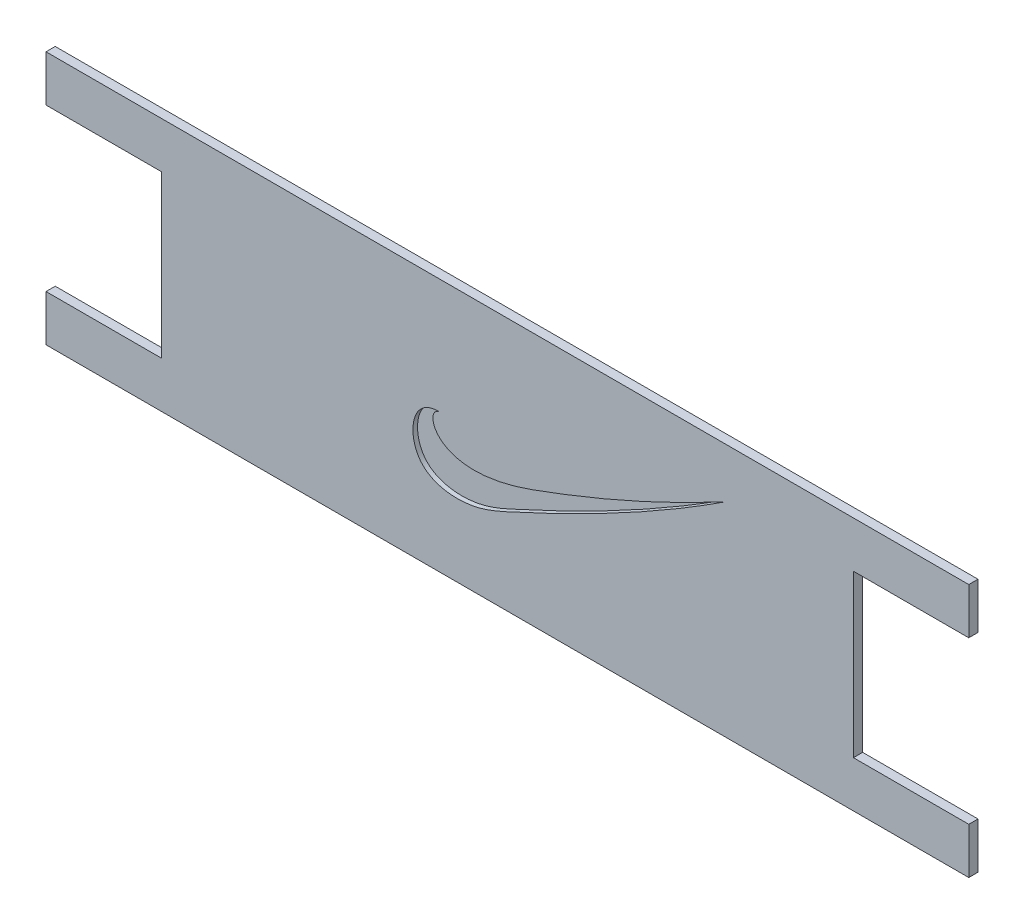
ISO-10303-21;
HEADER;
FILE_DESCRIPTION(('STEP AP214'),'2;1');
FILE_NAME('part.step','',(''),(''),'','','');
FILE_SCHEMA(('AUTOMOTIVE_DESIGN { 1 0 10303 214 1 1 1 1 }'));
ENDSEC;
DATA;
#1=APPLICATION_CONTEXT('core data for automotive mechanical design processes');
#2=APPLICATION_PROTOCOL_DEFINITION('international standard','automotive_design',2000,#1);
#3=PRODUCT_CONTEXT('',#1,'mechanical');
#4=PRODUCT('Part','Part','',(#3));
#5=PRODUCT_RELATED_PRODUCT_CATEGORY('part','',(#4));
#6=PRODUCT_DEFINITION_FORMATION('','',#4);
#7=PRODUCT_DEFINITION_CONTEXT('part definition',#1,'design');
#8=PRODUCT_DEFINITION('design','',#6,#7);
#9=PRODUCT_DEFINITION_SHAPE('','',#8);
#10=(LENGTH_UNIT() NAMED_UNIT(*) SI_UNIT(.MILLI.,.METRE.));
#11=(NAMED_UNIT(*) PLANE_ANGLE_UNIT() SI_UNIT($,.RADIAN.));
#12=(NAMED_UNIT(*) SI_UNIT($,.STERADIAN.) SOLID_ANGLE_UNIT());
#13=UNCERTAINTY_MEASURE_WITH_UNIT(LENGTH_MEASURE(1.E-05),#10,'distance_accuracy_value','');
#14=(GEOMETRIC_REPRESENTATION_CONTEXT(3) GLOBAL_UNCERTAINTY_ASSIGNED_CONTEXT((#13)) GLOBAL_UNIT_ASSIGNED_CONTEXT((#10,
#11,#12)) REPRESENTATION_CONTEXT('',''));
#15=CARTESIAN_POINT('',(0.,0.,0.));
#16=DIRECTION('',(0.,0.,1.));
#17=DIRECTION('',(1.,0.,0.));
#18=AXIS2_PLACEMENT_3D('',#15,#16,#17);
#19=CARTESIAN_POINT('',(-48.3108108108107,14.2439742014154,2.));
#20=DIRECTION('',(1.,0.,0.));
#21=DIRECTION('',(0.,1.,0.));
#22=AXIS2_PLACEMENT_3D('',#19,#20,#21);
#23=PLANE('',#22);
#24=DIRECTION('',(0.,-1.,0.));
#25=VECTOR('',#24,1.);
#26=CARTESIAN_POINT('',(-48.3108108108107,14.2439742014154,0.));
#27=LINE('',#26,#25);
#28=CARTESIAN_POINT('',(-48.3108108108107,14.2439742014154,0.));
#29=VERTEX_POINT('',#28);
#30=CARTESIAN_POINT('',(-48.3108108108107,4.24397420141542,0.));
#31=VERTEX_POINT('',#30);
#32=EDGE_CURVE('E176',#29,#31,#27,.T.);
#33=ORIENTED_EDGE('',*,*,#32,.T.);
#34=DIRECTION('',(0.,0.,-1.));
#35=VECTOR('',#34,1.);
#36=CARTESIAN_POINT('',(-48.3108108108107,4.24397420141542,2.));
#37=LINE('',#36,#35);
#38=CARTESIAN_POINT('',(-48.3108108108107,4.24397420141542,2.));
#39=VERTEX_POINT('',#38);
#40=EDGE_CURVE('E11',#39,#31,#37,.T.);
#41=ORIENTED_EDGE('',*,*,#40,.F.);
#42=DIRECTION('',(0.,-1.,0.));
#43=VECTOR('',#42,1.);
#44=CARTESIAN_POINT('',(-48.3108108108107,14.2439742014154,2.));
#45=LINE('',#44,#43);
#46=CARTESIAN_POINT('',(-48.3108108108107,14.2439742014154,2.));
#47=VERTEX_POINT('',#46);
#48=EDGE_CURVE('E212',#47,#39,#45,.T.);
#49=ORIENTED_EDGE('',*,*,#48,.F.);
#50=DIRECTION('',(0.,0.,-1.));
#51=VECTOR('',#50,1.);
#52=CARTESIAN_POINT('',(-48.3108108108107,14.2439742014154,2.));
#53=LINE('',#52,#51);
#54=EDGE_CURVE('E172',#47,#29,#53,.T.);
#55=ORIENTED_EDGE('',*,*,#54,.T.);
#56=EDGE_LOOP('',(#33,#41,#49,#55));
#57=FACE_BOUND('',#56,.T.);
#58=ADVANCED_FACE('F39',(#57),#23,.F.);
#59=CARTESIAN_POINT('',(-23.3108108108107,4.24397420141542,2.));
#60=DIRECTION('',(0.,1.,0.));
#61=DIRECTION('',(-1.,0.,0.));
#62=AXIS2_PLACEMENT_3D('',#59,#60,#61);
#63=PLANE('',#62);
#64=DIRECTION('',(1.,0.,0.));
#65=VECTOR('',#64,1.);
#66=CARTESIAN_POINT('',(-23.3108108108107,4.24397420141542,0.));
#67=LINE('',#66,#65);
#68=CARTESIAN_POINT('',(-23.3108108108107,4.24397420141542,0.));
#69=VERTEX_POINT('',#68);
#70=EDGE_CURVE('E180',#31,#69,#67,.T.);
#71=ORIENTED_EDGE('',*,*,#70,.T.);
#72=DIRECTION('',(0.,0.,-1.));
#73=VECTOR('',#72,1.);
#74=CARTESIAN_POINT('',(-23.3108108108107,4.24397420141542,2.));
#75=LINE('',#74,#73);
#76=CARTESIAN_POINT('',(-23.3108108108107,4.24397420141542,2.));
#77=VERTEX_POINT('',#76);
#78=EDGE_CURVE('E47',#77,#69,#75,.T.);
#79=ORIENTED_EDGE('',*,*,#78,.F.);
#80=DIRECTION('',(1.,0.,0.));
#81=VECTOR('',#80,1.);
#82=CARTESIAN_POINT('',(-23.3108108108107,4.24397420141542,2.));
#83=LINE('',#82,#81);
#84=EDGE_CURVE('E116',#39,#77,#83,.T.);
#85=ORIENTED_EDGE('',*,*,#84,.F.);
#86=ORIENTED_EDGE('',*,*,#40,.T.);
#87=EDGE_LOOP('',(#71,#79,#85,#86));
#88=FACE_BOUND('',#87,.T.);
#89=ADVANCED_FACE('F375',(#88),#63,.F.);
#90=CARTESIAN_POINT('',(-23.3108108108107,4.24397420141542,2.));
#91=DIRECTION('',(1.,0.,0.));
#92=DIRECTION('',(0.,0.,-1.));
#93=AXIS2_PLACEMENT_3D('',#90,#91,#92);
#94=PLANE('',#93);
#95=DIRECTION('',(0.,-1.,0.));
#96=VECTOR('',#95,1.);
#97=CARTESIAN_POINT('',(-23.3108108108107,4.24397420141542,0.));
#98=LINE('',#97,#96);
#99=CARTESIAN_POINT('',(-23.3108108108107,-30.7560257985846,0.));
#100=VERTEX_POINT('',#99);
#101=EDGE_CURVE('E184',#69,#100,#98,.T.);
#102=ORIENTED_EDGE('',*,*,#101,.T.);
#103=DIRECTION('',(0.,0.,-1.));
#104=VECTOR('',#103,1.);
#105=CARTESIAN_POINT('',(-23.3108108108107,-30.7560257985846,2.));
#106=LINE('',#105,#104);
#107=CARTESIAN_POINT('',(-23.3108108108107,-30.7560257985846,2.));
#108=VERTEX_POINT('',#107);
#109=EDGE_CURVE('E239',#108,#100,#106,.T.);
#110=ORIENTED_EDGE('',*,*,#109,.F.);
#111=DIRECTION('',(0.,-1.,0.));
#112=VECTOR('',#111,1.);
#113=CARTESIAN_POINT('',(-23.3108108108107,4.24397420141542,2.));
#114=LINE('',#113,#112);
#115=EDGE_CURVE('E249',#77,#108,#114,.T.);
#116=ORIENTED_EDGE('',*,*,#115,.F.);
#117=ORIENTED_EDGE('',*,*,#78,.T.);
#118=EDGE_LOOP('',(#102,#110,#116,#117));
#119=FACE_BOUND('',#118,.T.);
#120=ADVANCED_FACE('F247',(#119),#94,.F.);
#121=CARTESIAN_POINT('',(-48.3108108108107,-30.7560257985846,2.));
#122=DIRECTION('',(0.,-1.,0.));
#123=DIRECTION('',(0.,0.,-1.));
#124=AXIS2_PLACEMENT_3D('',#121,#122,#123);
#125=PLANE('',#124);
#126=DIRECTION('',(-1.,0.,0.));
#127=VECTOR('',#126,1.);
#128=CARTESIAN_POINT('',(-48.3108108108107,-30.7560257985846,0.));
#129=LINE('',#128,#127);
#130=CARTESIAN_POINT('',(-48.3108108108107,-30.7560257985846,0.));
#131=VERTEX_POINT('',#130);
#132=EDGE_CURVE('E187',#100,#131,#129,.T.);
#133=ORIENTED_EDGE('',*,*,#132,.T.);
#134=DIRECTION('',(0.,0.,-1.));
#135=VECTOR('',#134,1.);
#136=CARTESIAN_POINT('',(-48.3108108108107,-30.7560257985846,2.));
#137=LINE('',#136,#135);
#138=CARTESIAN_POINT('',(-48.3108108108107,-30.7560257985846,2.));
#139=VERTEX_POINT('',#138);
#140=EDGE_CURVE('E235',#139,#131,#137,.T.);
#141=ORIENTED_EDGE('',*,*,#140,.F.);
#142=DIRECTION('',(-1.,0.,0.));
#143=VECTOR('',#142,1.);
#144=CARTESIAN_POINT('',(-48.3108108108107,-30.7560257985846,2.));
#145=LINE('',#144,#143);
#146=EDGE_CURVE('E268',#108,#139,#145,.T.);
#147=ORIENTED_EDGE('',*,*,#146,.F.);
#148=ORIENTED_EDGE('',*,*,#109,.T.);
#149=EDGE_LOOP('',(#133,#141,#147,#148));
#150=FACE_BOUND('',#149,.T.);
#151=ADVANCED_FACE('F258',(#150),#125,.F.);
#152=CARTESIAN_POINT('',(-48.3108108108107,-30.7560257985846,2.));
#153=DIRECTION('',(1.,0.,0.));
#154=DIRECTION('',(0.,0.,-1.));
#155=AXIS2_PLACEMENT_3D('',#152,#153,#154);
#156=PLANE('',#155);
#157=DIRECTION('',(0.,-1.,0.));
#158=VECTOR('',#157,1.);
#159=CARTESIAN_POINT('',(-48.3108108108107,-30.7560257985846,0.));
#160=LINE('',#159,#158);
#161=CARTESIAN_POINT('',(-48.3108108108107,-40.7560257985846,0.));
#162=VERTEX_POINT('',#161);
#163=EDGE_CURVE('E190',#131,#162,#160,.T.);
#164=ORIENTED_EDGE('',*,*,#163,.T.);
#165=DIRECTION('',(0.,0.,-1.));
#166=VECTOR('',#165,1.);
#167=CARTESIAN_POINT('',(-48.3108108108107,-40.7560257985846,2.));
#168=LINE('',#167,#166);
#169=CARTESIAN_POINT('',(-48.3108108108107,-40.7560257985846,2.));
#170=VERTEX_POINT('',#169);
#171=EDGE_CURVE('E231',#170,#162,#168,.T.);
#172=ORIENTED_EDGE('',*,*,#171,.F.);
#173=DIRECTION('',(0.,-1.,0.));
#174=VECTOR('',#173,1.);
#175=CARTESIAN_POINT('',(-48.3108108108107,-30.7560257985846,2.));
#176=LINE('',#175,#174);
#177=EDGE_CURVE('E264',#139,#170,#176,.T.);
#178=ORIENTED_EDGE('',*,*,#177,.F.);
#179=ORIENTED_EDGE('',*,*,#140,.T.);
#180=EDGE_LOOP('',(#164,#172,#178,#179));
#181=FACE_BOUND('',#180,.T.);
#182=ADVANCED_FACE('F262',(#181),#156,.F.);
#183=CARTESIAN_POINT('',(-48.3108108108107,-40.7560257985846,2.));
#184=DIRECTION('',(0.,1.,0.));
#185=DIRECTION('',(0.,0.,1.));
#186=AXIS2_PLACEMENT_3D('',#183,#184,#185);
#187=PLANE('',#186);
#188=DIRECTION('',(1.,0.,0.));
#189=VECTOR('',#188,1.);
#190=CARTESIAN_POINT('',(-48.3108108108107,-40.7560257985846,0.));
#191=LINE('',#190,#189);
#192=CARTESIAN_POINT('',(151.689189189189,-40.7560257985846,0.));
#193=VERTEX_POINT('',#192);
#194=EDGE_CURVE('E193',#162,#193,#191,.T.);
#195=ORIENTED_EDGE('',*,*,#194,.T.);
#196=DIRECTION('',(0.,0.,-1.));
#197=VECTOR('',#196,1.);
#198=CARTESIAN_POINT('',(151.689189189189,-40.7560257985846,2.));
#199=LINE('',#198,#197);
#200=CARTESIAN_POINT('',(151.689189189189,-40.7560257985846,2.));
#201=VERTEX_POINT('',#200);
#202=EDGE_CURVE('E227',#201,#193,#199,.T.);
#203=ORIENTED_EDGE('',*,*,#202,.F.);
#204=DIRECTION('',(1.,0.,0.));
#205=VECTOR('',#204,1.);
#206=CARTESIAN_POINT('',(-48.3108108108107,-40.7560257985846,2.));
#207=LINE('',#206,#205);
#208=EDGE_CURVE('E267',#170,#201,#207,.T.);
#209=ORIENTED_EDGE('',*,*,#208,.F.);
#210=ORIENTED_EDGE('',*,*,#171,.T.);
#211=EDGE_LOOP('',(#195,#203,#209,#210));
#212=FACE_BOUND('',#211,.T.);
#213=ADVANCED_FACE('F365',(#212),#187,.F.);
#214=CARTESIAN_POINT('',(151.689189189189,-30.7560257985846,2.));
#215=DIRECTION('',(-1.,0.,0.));
#216=DIRECTION('',(0.,0.,1.));
#217=AXIS2_PLACEMENT_3D('',#214,#215,#216);
#218=PLANE('',#217);
#219=DIRECTION('',(0.,1.,0.));
#220=VECTOR('',#219,1.);
#221=CARTESIAN_POINT('',(151.689189189189,-30.7560257985846,0.));
#222=LINE('',#221,#220);
#223=CARTESIAN_POINT('',(151.689189189189,-30.7560257985846,0.));
#224=VERTEX_POINT('',#223);
#225=EDGE_CURVE('E196',#193,#224,#222,.T.);
#226=ORIENTED_EDGE('',*,*,#225,.T.);
#227=DIRECTION('',(0.,0.,-1.));
#228=VECTOR('',#227,1.);
#229=CARTESIAN_POINT('',(151.689189189189,-30.7560257985846,2.));
#230=LINE('',#229,#228);
#231=CARTESIAN_POINT('',(151.689189189189,-30.7560257985846,2.));
#232=VERTEX_POINT('',#231);
#233=EDGE_CURVE('E223',#232,#224,#230,.T.);
#234=ORIENTED_EDGE('',*,*,#233,.F.);
#235=DIRECTION('',(0.,1.,0.));
#236=VECTOR('',#235,1.);
#237=CARTESIAN_POINT('',(151.689189189189,-30.7560257985846,2.));
#238=LINE('',#237,#236);
#239=EDGE_CURVE('E272',#201,#232,#238,.T.);
#240=ORIENTED_EDGE('',*,*,#239,.F.);
#241=ORIENTED_EDGE('',*,*,#202,.T.);
#242=EDGE_LOOP('',(#226,#234,#240,#241));
#243=FACE_BOUND('',#242,.T.);
#244=ADVANCED_FACE('F362',(#243),#218,.F.);
#245=CARTESIAN_POINT('',(126.689189189189,-30.7560257985846,2.));
#246=DIRECTION('',(0.,-1.,0.));
#247=DIRECTION('',(0.,0.,-1.));
#248=AXIS2_PLACEMENT_3D('',#245,#246,#247);
#249=PLANE('',#248);
#250=DIRECTION('',(-1.,0.,0.));
#251=VECTOR('',#250,1.);
#252=CARTESIAN_POINT('',(126.689189189189,-30.7560257985846,0.));
#253=LINE('',#252,#251);
#254=CARTESIAN_POINT('',(126.689189189189,-30.7560257985846,0.));
#255=VERTEX_POINT('',#254);
#256=EDGE_CURVE('E199',#224,#255,#253,.T.);
#257=ORIENTED_EDGE('',*,*,#256,.T.);
#258=DIRECTION('',(0.,0.,-1.));
#259=VECTOR('',#258,1.);
#260=CARTESIAN_POINT('',(126.689189189189,-30.7560257985846,2.));
#261=LINE('',#260,#259);
#262=CARTESIAN_POINT('',(126.689189189189,-30.7560257985846,2.));
#263=VERTEX_POINT('',#262);
#264=EDGE_CURVE('E219',#263,#255,#261,.T.);
#265=ORIENTED_EDGE('',*,*,#264,.F.);
#266=DIRECTION('',(-1.,0.,0.));
#267=VECTOR('',#266,1.);
#268=CARTESIAN_POINT('',(126.689189189189,-30.7560257985846,2.));
#269=LINE('',#268,#267);
#270=EDGE_CURVE('E279',#232,#263,#269,.T.);
#271=ORIENTED_EDGE('',*,*,#270,.F.);
#272=ORIENTED_EDGE('',*,*,#233,.T.);
#273=EDGE_LOOP('',(#257,#265,#271,#272));
#274=FACE_BOUND('',#273,.T.);
#275=ADVANCED_FACE('F287',(#274),#249,.F.);
#276=CARTESIAN_POINT('',(126.689189189189,4.24397420141543,2.));
#277=DIRECTION('',(-1.,0.,0.));
#278=DIRECTION('',(0.,0.,1.));
#279=AXIS2_PLACEMENT_3D('',#276,#277,#278);
#280=PLANE('',#279);
#281=DIRECTION('',(0.,1.,0.));
#282=VECTOR('',#281,1.);
#283=CARTESIAN_POINT('',(126.689189189189,4.24397420141543,0.));
#284=LINE('',#283,#282);
#285=CARTESIAN_POINT('',(126.689189189189,4.24397420141543,0.));
#286=VERTEX_POINT('',#285);
#287=EDGE_CURVE('E202',#255,#286,#284,.T.);
#288=ORIENTED_EDGE('',*,*,#287,.T.);
#289=DIRECTION('',(0.,0.,-1.));
#290=VECTOR('',#289,1.);
#291=CARTESIAN_POINT('',(126.689189189189,4.24397420141543,2.));
#292=LINE('',#291,#290);
#293=CARTESIAN_POINT('',(126.689189189189,4.24397420141543,2.));
#294=VERTEX_POINT('',#293);
#295=EDGE_CURVE('E165',#294,#286,#292,.T.);
#296=ORIENTED_EDGE('',*,*,#295,.F.);
#297=DIRECTION('',(0.,1.,0.));
#298=VECTOR('',#297,1.);
#299=CARTESIAN_POINT('',(126.689189189189,4.24397420141543,2.));
#300=LINE('',#299,#298);
#301=EDGE_CURVE('E151',#263,#294,#300,.T.);
#302=ORIENTED_EDGE('',*,*,#301,.F.);
#303=ORIENTED_EDGE('',*,*,#264,.T.);
#304=EDGE_LOOP('',(#288,#296,#302,#303));
#305=FACE_BOUND('',#304,.T.);
#306=ADVANCED_FACE('F291',(#305),#280,.F.);
#307=CARTESIAN_POINT('',(126.689189189189,4.24397420141543,2.));
#308=DIRECTION('',(0.,1.,0.));
#309=DIRECTION('',(0.,0.,1.));
#310=AXIS2_PLACEMENT_3D('',#307,#308,#309);
#311=PLANE('',#310);
#312=DIRECTION('',(1.,0.,0.));
#313=VECTOR('',#312,1.);
#314=CARTESIAN_POINT('',(126.689189189189,4.24397420141543,0.));
#315=LINE('',#314,#313);
#316=CARTESIAN_POINT('',(151.689189189189,4.24397420141543,0.));
#317=VERTEX_POINT('',#316);
#318=EDGE_CURVE('E161',#286,#317,#315,.T.);
#319=ORIENTED_EDGE('',*,*,#318,.T.);
#320=DIRECTION('',(0.,0.,-1.));
#321=VECTOR('',#320,1.);
#322=CARTESIAN_POINT('',(151.689189189189,4.24397420141543,2.));
#323=LINE('',#322,#321);
#324=CARTESIAN_POINT('',(151.689189189189,4.24397420141543,2.));
#325=VERTEX_POINT('',#324);
#326=EDGE_CURVE('E158',#325,#317,#323,.T.);
#327=ORIENTED_EDGE('',*,*,#326,.F.);
#328=DIRECTION('',(1.,0.,0.));
#329=VECTOR('',#328,1.);
#330=CARTESIAN_POINT('',(126.689189189189,4.24397420141543,2.));
#331=LINE('',#330,#329);
#332=EDGE_CURVE('E144',#294,#325,#331,.T.);
#333=ORIENTED_EDGE('',*,*,#332,.F.);
#334=ORIENTED_EDGE('',*,*,#295,.T.);
#335=EDGE_LOOP('',(#319,#327,#333,#334));
#336=FACE_BOUND('',#335,.T.);
#337=ADVANCED_FACE('F159',(#336),#311,.F.);
#338=CARTESIAN_POINT('',(151.689189189189,14.2439742014154,2.));
#339=DIRECTION('',(-1.,0.,0.));
#340=DIRECTION('',(0.,0.,1.));
#341=AXIS2_PLACEMENT_3D('',#338,#339,#340);
#342=PLANE('',#341);
#343=DIRECTION('',(0.,1.,0.));
#344=VECTOR('',#343,1.);
#345=CARTESIAN_POINT('',(151.689189189189,14.2439742014154,0.));
#346=LINE('',#345,#344);
#347=CARTESIAN_POINT('',(151.689189189189,14.2439742014154,0.));
#348=VERTEX_POINT('',#347);
#349=EDGE_CURVE('E207',#317,#348,#346,.T.);
#350=ORIENTED_EDGE('',*,*,#349,.T.);
#351=DIRECTION('',(0.,0.,-1.));
#352=VECTOR('',#351,1.);
#353=CARTESIAN_POINT('',(151.689189189189,14.2439742014154,2.));
#354=LINE('',#353,#352);
#355=CARTESIAN_POINT('',(151.689189189189,14.2439742014154,2.));
#356=VERTEX_POINT('',#355);
#357=EDGE_CURVE('E166',#356,#348,#354,.T.);
#358=ORIENTED_EDGE('',*,*,#357,.F.);
#359=DIRECTION('',(0.,1.,0.));
#360=VECTOR('',#359,1.);
#361=CARTESIAN_POINT('',(151.689189189189,14.2439742014154,2.));
#362=LINE('',#361,#360);
#363=EDGE_CURVE('E148',#325,#356,#362,.T.);
#364=ORIENTED_EDGE('',*,*,#363,.F.);
#365=ORIENTED_EDGE('',*,*,#326,.T.);
#366=EDGE_LOOP('',(#350,#358,#364,#365));
#367=FACE_BOUND('',#366,.T.);
#368=ADVANCED_FACE('F168',(#367),#342,.F.);
#369=CARTESIAN_POINT('',(-48.3108108108107,14.2439742014154,2.));
#370=DIRECTION('',(0.,-1.,0.));
#371=DIRECTION('',(0.,0.,-1.));
#372=AXIS2_PLACEMENT_3D('',#369,#370,#371);
#373=PLANE('',#372);
#374=DIRECTION('',(-1.,0.,0.));
#375=VECTOR('',#374,1.);
#376=CARTESIAN_POINT('',(-48.3108108108107,14.2439742014154,0.));
#377=LINE('',#376,#375);
#378=EDGE_CURVE('E108',#348,#29,#377,.T.);
#379=ORIENTED_EDGE('',*,*,#378,.T.);
#380=ORIENTED_EDGE('',*,*,#54,.F.);
#381=DIRECTION('',(-1.,0.,0.));
#382=VECTOR('',#381,1.);
#383=CARTESIAN_POINT('',(-48.3108108108107,14.2439742014154,2.));
#384=LINE('',#383,#382);
#385=EDGE_CURVE('E63',#356,#47,#384,.T.);
#386=ORIENTED_EDGE('',*,*,#385,.F.);
#387=ORIENTED_EDGE('',*,*,#357,.T.);
#388=EDGE_LOOP('',(#379,#380,#386,#387));
#389=FACE_BOUND('',#388,.T.);
#390=ADVANCED_FACE('F292',(#389),#373,.F.);
#391=CARTESIAN_POINT('',(0.,0.,2.));
#392=DIRECTION('',(0.,0.,-1.));
#393=DIRECTION('',(-1.,0.,0.));
#394=AXIS2_PLACEMENT_3D('',#391,#392,#393);
#395=PLANE('',#394);
#396=CARTESIAN_POINT('',(98.853365994267,3.33744293324299,2.));
#397=CARTESIAN_POINT('',(87.6648975870834,-2.5949860423463,2.));
#398=CARTESIAN_POINT('',(74.2200480319826,-9.04625789215874,2.));
#399=CARTESIAN_POINT('',(35.3006277716933,-23.2164679069715,2.));
#400=CARTESIAN_POINT('',(33.4741669526193,-10.6241994218104,2.));
#401=CARTESIAN_POINT('',(37.1894848239519,-10.7182946864612,2.));
#402=B_SPLINE_CURVE_WITH_KNOTS('',3,(#396,#397,#398,#399,#400,#401),.UNSPECIFIED.,.F.,.F.,(4,1,
1,4),(0.,0.40738033918613,0.482234890207092,1.),.UNSPECIFIED.);
#403=CARTESIAN_POINT('',(98.853365994267,3.33744293324299,2.));
#404=VERTEX_POINT('',#403);
#405=CARTESIAN_POINT('',(37.1894848239519,-10.7182946864612,2.));
#406=VERTEX_POINT('',#405);
#407=EDGE_CURVE('E308',#404,#406,#402,.T.);
#408=ORIENTED_EDGE('',*,*,#407,.F.);
#409=CARTESIAN_POINT('',(37.1894848239519,-10.7182946864612,2.));
#410=CARTESIAN_POINT('',(30.8159444628726,-10.3327451054599,2.));
#411=CARTESIAN_POINT('',(29.1568750118241,-24.1698529877593,2.));
#412=CARTESIAN_POINT('',(43.2501864344776,-25.8532744897858,2.));
#413=CARTESIAN_POINT('',(65.1901618859945,-16.1789180432049,2.));
#414=CARTESIAN_POINT('',(83.9965046189798,-6.3847686565354,2.));
#415=CARTESIAN_POINT('',(98.853365994267,3.33744293324299,2.));
#416=B_SPLINE_CURVE_WITH_KNOTS('',3,(#409,#410,#411,#412,#413,#414,#415),.UNSPECIFIED.,.F.,.F.,
(4,1,1,1,4),(0.,0.163170519365482,0.2917639299808,0.388322167502561,1.),.UNSPECIFIED.);
#417=EDGE_CURVE('E54',#406,#404,#416,.T.);
#418=ORIENTED_EDGE('',*,*,#417,.F.);
#419=EDGE_LOOP('',(#408,#418));
#420=FACE_BOUND('',#419,.T.);
#421=ORIENTED_EDGE('',*,*,#48,.T.);
#422=ORIENTED_EDGE('',*,*,#84,.T.);
#423=ORIENTED_EDGE('',*,*,#115,.T.);
#424=ORIENTED_EDGE('',*,*,#146,.T.);
#425=ORIENTED_EDGE('',*,*,#177,.T.);
#426=ORIENTED_EDGE('',*,*,#208,.T.);
#427=ORIENTED_EDGE('',*,*,#239,.T.);
#428=ORIENTED_EDGE('',*,*,#270,.T.);
#429=ORIENTED_EDGE('',*,*,#301,.T.);
#430=ORIENTED_EDGE('',*,*,#332,.T.);
#431=ORIENTED_EDGE('',*,*,#363,.T.);
#432=ORIENTED_EDGE('',*,*,#385,.T.);
#433=EDGE_LOOP('',(#421,#422,#423,#424,#425,#426,#427,#428,#429,#430,#431,#432));
#434=FACE_BOUND('',#433,.T.);
#435=ADVANCED_FACE('F146',(#420,#434),#395,.F.);
#436=CARTESIAN_POINT('',(0.,0.,0.));
#437=DIRECTION('',(0.,0.,-1.));
#438=DIRECTION('',(-1.,0.,0.));
#439=AXIS2_PLACEMENT_3D('',#436,#437,#438);
#440=PLANE('',#439);
#441=ORIENTED_EDGE('',*,*,#32,.F.);
#442=ORIENTED_EDGE('',*,*,#378,.F.);
#443=ORIENTED_EDGE('',*,*,#349,.F.);
#444=ORIENTED_EDGE('',*,*,#318,.F.);
#445=ORIENTED_EDGE('',*,*,#287,.F.);
#446=ORIENTED_EDGE('',*,*,#256,.F.);
#447=ORIENTED_EDGE('',*,*,#225,.F.);
#448=ORIENTED_EDGE('',*,*,#194,.F.);
#449=ORIENTED_EDGE('',*,*,#163,.F.);
#450=ORIENTED_EDGE('',*,*,#132,.F.);
#451=ORIENTED_EDGE('',*,*,#101,.F.);
#452=ORIENTED_EDGE('',*,*,#70,.F.);
#453=EDGE_LOOP('',(#441,#442,#443,#444,#445,#446,#447,#448,#449,#450,#451,#452));
#454=FACE_BOUND('',#453,.T.);
#455=ADVANCED_FACE('F253',(#454),#440,.T.);
#456=CARTESIAN_POINT('',(37.1894848239519,-10.7182946864612,1.));
#457=CARTESIAN_POINT('',(30.8159444628726,-10.3327451054599,1.));
#458=CARTESIAN_POINT('',(29.1568750118241,-24.1698529877593,1.));
#459=CARTESIAN_POINT('',(43.2501864344776,-25.8532744897858,1.));
#460=CARTESIAN_POINT('',(65.1901618859945,-16.1789180432049,1.));
#461=CARTESIAN_POINT('',(83.9965046189798,-6.3847686565354,1.));
#462=CARTESIAN_POINT('',(98.853365994267,3.33744293324299,1.));
#463=B_SPLINE_CURVE_WITH_KNOTS('',3,(#456,#457,#458,#459,#460,#461,#462),.UNSPECIFIED.,.F.,.F.,
(4,1,1,1,4),(0.,0.163170519365482,0.2917639299808,0.388322167502561,1.),.UNSPECIFIED.);
#464=DIRECTION('',(0.,0.,1.));
#465=VECTOR('',#464,1.);
#466=SURFACE_OF_LINEAR_EXTRUSION('',#463,#465);
#467=ORIENTED_EDGE('',*,*,#417,.T.);
#468=DIRECTION('',(0.,0.,1.));
#469=VECTOR('',#468,1.);
#470=CARTESIAN_POINT('',(98.853365994267,3.33744293324299,1.));
#471=LINE('',#470,#469);
#472=CARTESIAN_POINT('',(98.853365994267,3.33744293324299,1.));
#473=VERTEX_POINT('',#472);
#474=EDGE_CURVE('E301',#473,#404,#471,.T.);
#475=ORIENTED_EDGE('',*,*,#474,.F.);
#476=CARTESIAN_POINT('',(37.1894848239519,-10.7182946864612,1.));
#477=VERTEX_POINT('',#476);
#478=EDGE_CURVE('E314',#477,#473,#463,.T.);
#479=ORIENTED_EDGE('',*,*,#478,.F.);
#480=DIRECTION('',(0.,0.,1.));
#481=VECTOR('',#480,1.);
#482=CARTESIAN_POINT('',(37.1894848239519,-10.7182946864612,1.));
#483=LINE('',#482,#481);
#484=EDGE_CURVE('E181',#477,#406,#483,.T.);
#485=ORIENTED_EDGE('',*,*,#484,.T.);
#486=EDGE_LOOP('',(#467,#475,#479,#485));
#487=FACE_BOUND('',#486,.T.);
#488=ADVANCED_FACE('F343',(#487),#466,.F.);
#489=CARTESIAN_POINT('',(98.853365994267,3.33744293324299,1.));
#490=CARTESIAN_POINT('',(87.6648975870834,-2.5949860423463,1.));
#491=CARTESIAN_POINT('',(74.2200480319826,-9.04625789215874,1.));
#492=CARTESIAN_POINT('',(35.3006277716933,-23.2164679069715,1.));
#493=CARTESIAN_POINT('',(33.4741669526193,-10.6241994218104,1.));
#494=CARTESIAN_POINT('',(37.1894848239519,-10.7182946864612,1.));
#495=B_SPLINE_CURVE_WITH_KNOTS('',3,(#489,#490,#491,#492,#493,#494),.UNSPECIFIED.,.F.,.F.,(4,1,
1,4),(0.,0.40738033918613,0.482234890207092,1.),.UNSPECIFIED.);
#496=DIRECTION('',(0.,0.,1.));
#497=VECTOR('',#496,1.);
#498=SURFACE_OF_LINEAR_EXTRUSION('',#495,#497);
#499=ORIENTED_EDGE('',*,*,#407,.T.);
#500=ORIENTED_EDGE('',*,*,#484,.F.);
#501=EDGE_CURVE('E305',#473,#477,#495,.T.);
#502=ORIENTED_EDGE('',*,*,#501,.F.);
#503=ORIENTED_EDGE('',*,*,#474,.T.);
#504=EDGE_LOOP('',(#499,#500,#502,#503));
#505=FACE_BOUND('',#504,.T.);
#506=ADVANCED_FACE('F338',(#505),#498,.F.);
#507=CARTESIAN_POINT('',(60.4966563447188,-18.0071545296647,1.));
#508=DIRECTION('',(0.,0.,-1.));
#509=DIRECTION('',(-1.,0.,0.));
#510=AXIS2_PLACEMENT_3D('',#507,#508,#509);
#511=PLANE('',#510);
#512=ORIENTED_EDGE('',*,*,#478,.T.);
#513=ORIENTED_EDGE('',*,*,#501,.T.);
#514=EDGE_LOOP('',(#512,#513));
#515=FACE_BOUND('',#514,.T.);
#516=ADVANCED_FACE('F342',(#515),#511,.F.);
#517=CLOSED_SHELL('',(#58,#89,#120,#151,#182,#213,#244,#275,#306,#337,#368,#390,#435,#455,#488,
#506,#516));
#518=MANIFOLD_SOLID_BREP('B2',#517);
#519=ADVANCED_BREP_SHAPE_REPRESENTATION('',(#18,#518),#14);
#520=SHAPE_DEFINITION_REPRESENTATION(#9,#519);
ENDSEC;
END-ISO-10303-21;
